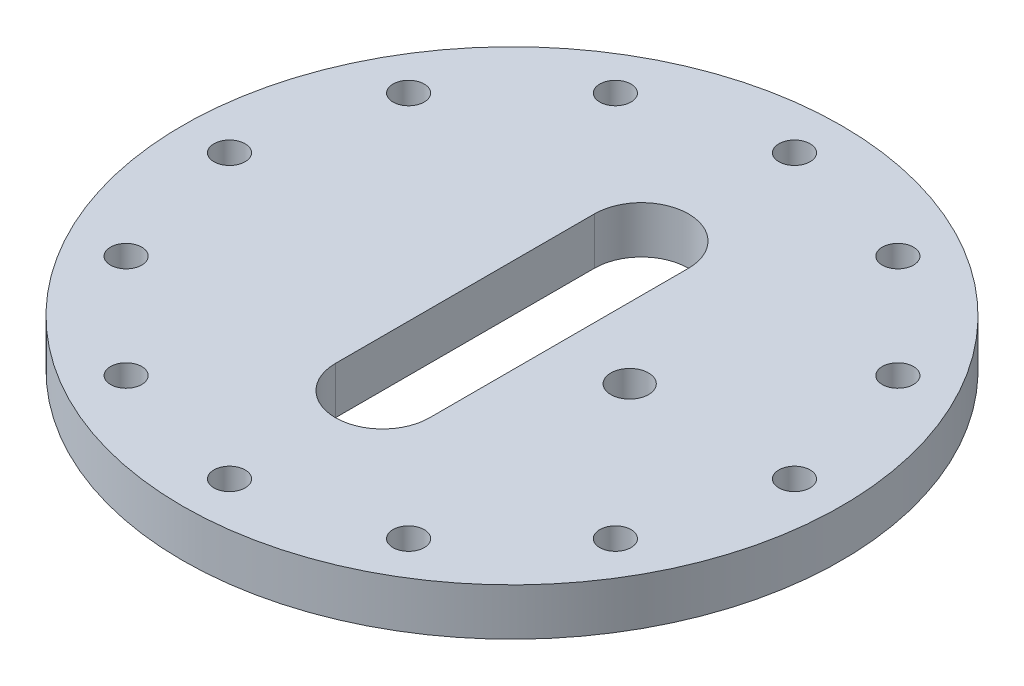
ISO-10303-21;
HEADER;
FILE_DESCRIPTION(('STEP AP214'),'2;1');
FILE_NAME('part.step','',(''),(''),'','','');
FILE_SCHEMA(('AUTOMOTIVE_DESIGN { 1 0 10303 214 1 1 1 1 }'));
ENDSEC;
DATA;
#1=APPLICATION_CONTEXT('core data for automotive mechanical design processes');
#2=APPLICATION_PROTOCOL_DEFINITION('international standard','automotive_design',2000,#1);
#3=PRODUCT_CONTEXT('',#1,'mechanical');
#4=PRODUCT('Part','Part','',(#3));
#5=PRODUCT_RELATED_PRODUCT_CATEGORY('part','',(#4));
#6=PRODUCT_DEFINITION_FORMATION('','',#4);
#7=PRODUCT_DEFINITION_CONTEXT('part definition',#1,'design');
#8=PRODUCT_DEFINITION('design','',#6,#7);
#9=PRODUCT_DEFINITION_SHAPE('','',#8);
#10=(LENGTH_UNIT() NAMED_UNIT(*) SI_UNIT(.MILLI.,.METRE.));
#11=(NAMED_UNIT(*) PLANE_ANGLE_UNIT() SI_UNIT($,.RADIAN.));
#12=(NAMED_UNIT(*) SI_UNIT($,.STERADIAN.) SOLID_ANGLE_UNIT());
#13=UNCERTAINTY_MEASURE_WITH_UNIT(LENGTH_MEASURE(1.E-05),#10,'distance_accuracy_value','');
#14=(GEOMETRIC_REPRESENTATION_CONTEXT(3) GLOBAL_UNCERTAINTY_ASSIGNED_CONTEXT((#13)) GLOBAL_UNIT_ASSIGNED_CONTEXT((#10,
#11,#12)) REPRESENTATION_CONTEXT('',''));
#15=CARTESIAN_POINT('',(0.,0.,0.));
#16=DIRECTION('',(0.,0.,1.));
#17=DIRECTION('',(1.,0.,0.));
#18=AXIS2_PLACEMENT_3D('',#15,#16,#17);
#19=CARTESIAN_POINT('',(0.,0.,0.));
#20=DIRECTION('',(0.,-1.,0.));
#21=DIRECTION('',(0.,0.,-1.));
#22=AXIS2_PLACEMENT_3D('',#19,#20,#21);
#23=PLANE('',#22);
#24=CARTESIAN_POINT('',(31.75,0.,0.));
#25=DIRECTION('',(0.,1.,0.));
#26=DIRECTION('',(0.,0.,1.));
#27=AXIS2_PLACEMENT_3D('',#24,#25,#26);
#28=CIRCLE('',#27,5.07999999999999);
#29=CARTESIAN_POINT('',(31.75,0.,5.07999999999999));
#30=VERTEX_POINT('',#29);
#31=EDGE_CURVE('E213',#30,#30,#28,.T.);
#32=ORIENTED_EDGE('',*,*,#31,.T.);
#33=EDGE_LOOP('',(#32));
#34=FACE_BOUND('',#33,.T.);
#35=CARTESIAN_POINT('',(-38.0999999999992,0.,-65.9911357683747));
#36=DIRECTION('',(0.,1.,0.));
#37=DIRECTION('',(0.,0.,1.));
#38=AXIS2_PLACEMENT_3D('',#35,#36,#37);
#39=CIRCLE('',#38,4.21639999999999);
#40=CARTESIAN_POINT('',(-38.0999999999992,0.,-61.7747357683747));
#41=VERTEX_POINT('',#40);
#42=EDGE_CURVE('E226',#41,#41,#39,.T.);
#43=ORIENTED_EDGE('',*,*,#42,.T.);
#44=EDGE_LOOP('',(#43));
#45=FACE_BOUND('',#44,.T.);
#46=CARTESIAN_POINT('',(-65.9911357683738,0.,-38.1000000000008));
#47=DIRECTION('',(0.,1.,0.));
#48=DIRECTION('',(0.,0.,1.));
#49=AXIS2_PLACEMENT_3D('',#46,#47,#48);
#50=CIRCLE('',#49,4.21639999999999);
#51=CARTESIAN_POINT('',(-65.9911357683738,0.,-33.8836000000008));
#52=VERTEX_POINT('',#51);
#53=EDGE_CURVE('E234',#52,#52,#50,.T.);
#54=ORIENTED_EDGE('',*,*,#53,.T.);
#55=EDGE_LOOP('',(#54));
#56=FACE_BOUND('',#55,.T.);
#57=CARTESIAN_POINT('',(0.,0.,76.2));
#58=DIRECTION('',(0.,1.,0.));
#59=DIRECTION('',(0.,0.,1.));
#60=AXIS2_PLACEMENT_3D('',#57,#58,#59);
#61=CIRCLE('',#60,4.2164);
#62=CARTESIAN_POINT('',(0.,0.,80.4164));
#63=VERTEX_POINT('',#62);
#64=EDGE_CURVE('E266',#63,#63,#61,.T.);
#65=ORIENTED_EDGE('',*,*,#64,.T.);
#66=EDGE_LOOP('',(#65));
#67=FACE_BOUND('',#66,.T.);
#68=CARTESIAN_POINT('',(38.0999999999996,0.,65.9911357683744));
#69=DIRECTION('',(0.,1.,0.));
#70=DIRECTION('',(0.,0.,1.));
#71=AXIS2_PLACEMENT_3D('',#68,#69,#70);
#72=CIRCLE('',#71,4.21639999999999);
#73=CARTESIAN_POINT('',(38.0999999999996,0.,70.2075357683745));
#74=VERTEX_POINT('',#73);
#75=EDGE_CURVE('E274',#74,#74,#72,.T.);
#76=ORIENTED_EDGE('',*,*,#75,.T.);
#77=EDGE_LOOP('',(#76));
#78=FACE_BOUND('',#77,.T.);
#79=CARTESIAN_POINT('',(65.9911357683741,0.,38.1000000000003));
#80=DIRECTION('',(0.,1.,0.));
#81=DIRECTION('',(0.,0.,1.));
#82=AXIS2_PLACEMENT_3D('',#79,#80,#81);
#83=CIRCLE('',#82,4.21639999999999);
#84=CARTESIAN_POINT('',(65.9911357683741,0.,42.3164000000003));
#85=VERTEX_POINT('',#84);
#86=EDGE_CURVE('E282',#85,#85,#83,.T.);
#87=ORIENTED_EDGE('',*,*,#86,.T.);
#88=EDGE_LOOP('',(#87));
#89=FACE_BOUND('',#88,.T.);
#90=CARTESIAN_POINT('',(76.2,0.,2.66050878019847E-13));
#91=DIRECTION('',(0.,1.,0.));
#92=DIRECTION('',(0.,0.,1.));
#93=AXIS2_PLACEMENT_3D('',#90,#91,#92);
#94=CIRCLE('',#93,4.21639999999999);
#95=CARTESIAN_POINT('',(76.2,0.,4.21640000000026));
#96=VERTEX_POINT('',#95);
#97=EDGE_CURVE('E290',#96,#96,#94,.T.);
#98=ORIENTED_EDGE('',*,*,#97,.T.);
#99=EDGE_LOOP('',(#98));
#100=FACE_BOUND('',#99,.T.);
#101=CARTESIAN_POINT('',(65.9911357683743,0.,-38.0999999999999));
#102=DIRECTION('',(0.,1.,0.));
#103=DIRECTION('',(0.,0.,1.));
#104=AXIS2_PLACEMENT_3D('',#101,#102,#103);
#105=CIRCLE('',#104,4.21639999999999);
#106=CARTESIAN_POINT('',(65.9911357683743,0.,-33.8835999999999));
#107=VERTEX_POINT('',#106);
#108=EDGE_CURVE('E298',#107,#107,#105,.T.);
#109=ORIENTED_EDGE('',*,*,#108,.T.);
#110=EDGE_LOOP('',(#109));
#111=FACE_BOUND('',#110,.T.);
#112=CARTESIAN_POINT('',(38.1000000000001,0.,-65.9911357683742));
#113=DIRECTION('',(0.,1.,0.));
#114=DIRECTION('',(0.,0.,1.));
#115=AXIS2_PLACEMENT_3D('',#112,#113,#114);
#116=CIRCLE('',#115,4.21639999999999);
#117=CARTESIAN_POINT('',(38.1000000000001,0.,-61.7747357683742));
#118=VERTEX_POINT('',#117);
#119=EDGE_CURVE('E306',#118,#118,#116,.T.);
#120=ORIENTED_EDGE('',*,*,#119,.T.);
#121=EDGE_LOOP('',(#120));
#122=FACE_BOUND('',#121,.T.);
#123=CARTESIAN_POINT('',(0.,0.,-76.2));
#124=DIRECTION('',(0.,1.,0.));
#125=DIRECTION('',(0.,0.,1.));
#126=AXIS2_PLACEMENT_3D('',#123,#124,#125);
#127=CIRCLE('',#126,4.2164);
#128=CARTESIAN_POINT('',(0.,0.,-71.9836));
#129=VERTEX_POINT('',#128);
#130=EDGE_CURVE('E107',#129,#129,#127,.T.);
#131=ORIENTED_EDGE('',*,*,#130,.T.);
#132=EDGE_LOOP('',(#131));
#133=FACE_BOUND('',#132,.T.);
#134=CARTESIAN_POINT('',(0.,0.,-34.925));
#135=DIRECTION('',(0.,1.,0.));
#136=DIRECTION('',(0.,0.,-1.));
#137=AXIS2_PLACEMENT_3D('',#134,#135,#136);
#138=CIRCLE('',#137,12.7);
#139=CARTESIAN_POINT('',(12.7,0.,-34.925));
#140=VERTEX_POINT('',#139);
#141=CARTESIAN_POINT('',(-12.7,0.,-34.925));
#142=VERTEX_POINT('',#141);
#143=EDGE_CURVE('E82',#140,#142,#138,.T.);
#144=ORIENTED_EDGE('',*,*,#143,.T.);
#145=DIRECTION('',(0.,0.,1.));
#146=VECTOR('',#145,1.);
#147=CARTESIAN_POINT('',(-12.7,0.,-34.925));
#148=LINE('',#147,#146);
#149=CARTESIAN_POINT('',(-12.7,0.,34.925));
#150=VERTEX_POINT('',#149);
#151=EDGE_CURVE('E92',#142,#150,#148,.T.);
#152=ORIENTED_EDGE('',*,*,#151,.T.);
#153=CARTESIAN_POINT('',(0.,0.,34.925));
#154=DIRECTION('',(0.,1.,0.));
#155=DIRECTION('',(0.,0.,1.));
#156=AXIS2_PLACEMENT_3D('',#153,#154,#155);
#157=CIRCLE('',#156,12.7);
#158=CARTESIAN_POINT('',(12.7,0.,34.925));
#159=VERTEX_POINT('',#158);
#160=EDGE_CURVE('E54',#150,#159,#157,.T.);
#161=ORIENTED_EDGE('',*,*,#160,.T.);
#162=DIRECTION('',(0.,0.,-1.));
#163=VECTOR('',#162,1.);
#164=CARTESIAN_POINT('',(12.7,0.,-34.925));
#165=LINE('',#164,#163);
#166=EDGE_CURVE('E89',#159,#140,#165,.T.);
#167=ORIENTED_EDGE('',*,*,#166,.T.);
#168=EDGE_LOOP('',(#144,#152,#161,#167));
#169=FACE_BOUND('',#168,.T.);
#170=CARTESIAN_POINT('',(0.,0.,0.));
#171=DIRECTION('',(0.,1.,0.));
#172=DIRECTION('',(0.,0.,1.));
#173=AXIS2_PLACEMENT_3D('',#170,#171,#172);
#174=CIRCLE('',#173,88.9);
#175=CARTESIAN_POINT('',(0.,0.,88.9));
#176=VERTEX_POINT('',#175);
#177=EDGE_CURVE('E11',#176,#176,#174,.T.);
#178=ORIENTED_EDGE('',*,*,#177,.F.);
#179=EDGE_LOOP('',(#178));
#180=FACE_BOUND('',#179,.T.);
#181=CARTESIAN_POINT('',(-38.1000000000005,0.,65.9911357683739));
#182=DIRECTION('',(0.,1.,0.));
#183=DIRECTION('',(0.,0.,1.));
#184=AXIS2_PLACEMENT_3D('',#181,#182,#183);
#185=CIRCLE('',#184,4.21639999999999);
#186=CARTESIAN_POINT('',(-38.1000000000005,0.,70.2075357683739));
#187=VERTEX_POINT('',#186);
#188=EDGE_CURVE('E258',#187,#187,#185,.T.);
#189=ORIENTED_EDGE('',*,*,#188,.T.);
#190=EDGE_LOOP('',(#189));
#191=FACE_BOUND('',#190,.T.);
#192=CARTESIAN_POINT('',(-65.9911357683746,0.,38.0999999999994));
#193=DIRECTION('',(0.,1.,0.));
#194=DIRECTION('',(0.,0.,1.));
#195=AXIS2_PLACEMENT_3D('',#192,#193,#194);
#196=CIRCLE('',#195,4.21639999999999);
#197=CARTESIAN_POINT('',(-65.9911357683746,0.,42.3163999999994));
#198=VERTEX_POINT('',#197);
#199=EDGE_CURVE('E250',#198,#198,#196,.T.);
#200=ORIENTED_EDGE('',*,*,#199,.T.);
#201=EDGE_LOOP('',(#200));
#202=FACE_BOUND('',#201,.T.);
#203=CARTESIAN_POINT('',(-76.2,0.,-7.9815263405954E-13));
#204=DIRECTION('',(0.,1.,0.));
#205=DIRECTION('',(0.,0.,1.));
#206=AXIS2_PLACEMENT_3D('',#203,#204,#205);
#207=CIRCLE('',#206,4.21639999999999);
#208=CARTESIAN_POINT('',(-76.2,0.,4.2163999999992));
#209=VERTEX_POINT('',#208);
#210=EDGE_CURVE('E242',#209,#209,#207,.T.);
#211=ORIENTED_EDGE('',*,*,#210,.T.);
#212=EDGE_LOOP('',(#211));
#213=FACE_BOUND('',#212,.T.);
#214=ADVANCED_FACE('F39',(#34,#45,#56,#67,#78,#89,#100,#111,#122,#133,#169,#180,#191,#202,#213),
#23,.T.);
#215=CARTESIAN_POINT('',(0.,12.7,0.));
#216=DIRECTION('',(0.,1.,0.));
#217=DIRECTION('',(0.,0.,1.));
#218=AXIS2_PLACEMENT_3D('',#215,#216,#217);
#219=CYLINDRICAL_SURFACE('',#218,88.9);
#220=ORIENTED_EDGE('',*,*,#177,.T.);
#221=EDGE_LOOP('',(#220));
#222=FACE_BOUND('',#221,.T.);
#223=CARTESIAN_POINT('',(0.,12.7,0.));
#224=DIRECTION('',(0.,1.,0.));
#225=DIRECTION('',(0.,0.,1.));
#226=AXIS2_PLACEMENT_3D('',#223,#224,#225);
#227=CIRCLE('',#226,88.9);
#228=CARTESIAN_POINT('',(0.,12.7,88.9));
#229=VERTEX_POINT('',#228);
#230=EDGE_CURVE('E47',#229,#229,#227,.T.);
#231=ORIENTED_EDGE('',*,*,#230,.F.);
#232=EDGE_LOOP('',(#231));
#233=FACE_BOUND('',#232,.T.);
#234=ADVANCED_FACE('F135',(#222,#233),#219,.T.);
#235=CARTESIAN_POINT('',(-88.9,12.7,0.));
#236=DIRECTION('',(0.,1.,0.));
#237=DIRECTION('',(0.,0.,1.));
#238=AXIS2_PLACEMENT_3D('',#235,#236,#237);
#239=PLANE('',#238);
#240=CARTESIAN_POINT('',(31.75,12.7,0.));
#241=DIRECTION('',(0.,1.,0.));
#242=DIRECTION('',(0.,0.,1.));
#243=AXIS2_PLACEMENT_3D('',#240,#241,#242);
#244=CIRCLE('',#243,5.08);
#245=CARTESIAN_POINT('',(31.75,12.7,5.08));
#246=VERTEX_POINT('',#245);
#247=EDGE_CURVE('E216',#246,#246,#244,.T.);
#248=ORIENTED_EDGE('',*,*,#247,.F.);
#249=EDGE_LOOP('',(#248));
#250=FACE_BOUND('',#249,.T.);
#251=CARTESIAN_POINT('',(-38.0999999999992,12.7,-65.9911357683747));
#252=DIRECTION('',(0.,1.,0.));
#253=DIRECTION('',(0.,0.,1.));
#254=AXIS2_PLACEMENT_3D('',#251,#252,#253);
#255=CIRCLE('',#254,4.2164);
#256=CARTESIAN_POINT('',(-38.0999999999992,12.7,-61.7747357683747));
#257=VERTEX_POINT('',#256);
#258=EDGE_CURVE('E220',#257,#257,#255,.T.);
#259=ORIENTED_EDGE('',*,*,#258,.F.);
#260=EDGE_LOOP('',(#259));
#261=FACE_BOUND('',#260,.T.);
#262=CARTESIAN_POINT('',(-65.9911357683738,12.7,-38.1000000000008));
#263=DIRECTION('',(0.,1.,0.));
#264=DIRECTION('',(0.,0.,1.));
#265=AXIS2_PLACEMENT_3D('',#262,#263,#264);
#266=CIRCLE('',#265,4.21639999999999);
#267=CARTESIAN_POINT('',(-65.9911357683738,12.7,-33.8836000000008));
#268=VERTEX_POINT('',#267);
#269=EDGE_CURVE('E230',#268,#268,#266,.T.);
#270=ORIENTED_EDGE('',*,*,#269,.F.);
#271=EDGE_LOOP('',(#270));
#272=FACE_BOUND('',#271,.T.);
#273=CARTESIAN_POINT('',(-76.2,12.7,-7.9815263405954E-13));
#274=DIRECTION('',(0.,1.,0.));
#275=DIRECTION('',(0.,0.,1.));
#276=AXIS2_PLACEMENT_3D('',#273,#274,#275);
#277=CIRCLE('',#276,4.21639999999999);
#278=CARTESIAN_POINT('',(-76.2,12.7,4.2163999999992));
#279=VERTEX_POINT('',#278);
#280=EDGE_CURVE('E238',#279,#279,#277,.T.);
#281=ORIENTED_EDGE('',*,*,#280,.F.);
#282=EDGE_LOOP('',(#281));
#283=FACE_BOUND('',#282,.T.);
#284=CARTESIAN_POINT('',(-65.9911357683746,12.7,38.0999999999994));
#285=DIRECTION('',(0.,1.,0.));
#286=DIRECTION('',(0.,0.,1.));
#287=AXIS2_PLACEMENT_3D('',#284,#285,#286);
#288=CIRCLE('',#287,4.21639999999999);
#289=CARTESIAN_POINT('',(-65.9911357683746,12.7,42.3163999999994));
#290=VERTEX_POINT('',#289);
#291=EDGE_CURVE('E246',#290,#290,#288,.T.);
#292=ORIENTED_EDGE('',*,*,#291,.F.);
#293=EDGE_LOOP('',(#292));
#294=FACE_BOUND('',#293,.T.);
#295=CARTESIAN_POINT('',(-38.1000000000005,12.7,65.9911357683739));
#296=DIRECTION('',(0.,1.,0.));
#297=DIRECTION('',(0.,0.,1.));
#298=AXIS2_PLACEMENT_3D('',#295,#296,#297);
#299=CIRCLE('',#298,4.2164);
#300=CARTESIAN_POINT('',(-38.1000000000005,12.7,70.2075357683739));
#301=VERTEX_POINT('',#300);
#302=EDGE_CURVE('E254',#301,#301,#299,.T.);
#303=ORIENTED_EDGE('',*,*,#302,.F.);
#304=EDGE_LOOP('',(#303));
#305=FACE_BOUND('',#304,.T.);
#306=CARTESIAN_POINT('',(0.,12.7,76.2));
#307=DIRECTION('',(0.,1.,0.));
#308=DIRECTION('',(0.,0.,1.));
#309=AXIS2_PLACEMENT_3D('',#306,#307,#308);
#310=CIRCLE('',#309,4.2164);
#311=CARTESIAN_POINT('',(0.,12.7,80.4164));
#312=VERTEX_POINT('',#311);
#313=EDGE_CURVE('E262',#312,#312,#310,.T.);
#314=ORIENTED_EDGE('',*,*,#313,.F.);
#315=EDGE_LOOP('',(#314));
#316=FACE_BOUND('',#315,.T.);
#317=CARTESIAN_POINT('',(38.0999999999996,12.7,65.9911357683744));
#318=DIRECTION('',(0.,1.,0.));
#319=DIRECTION('',(0.,0.,1.));
#320=AXIS2_PLACEMENT_3D('',#317,#318,#319);
#321=CIRCLE('',#320,4.21639999999999);
#322=CARTESIAN_POINT('',(38.0999999999996,12.7,70.2075357683745));
#323=VERTEX_POINT('',#322);
#324=EDGE_CURVE('E270',#323,#323,#321,.T.);
#325=ORIENTED_EDGE('',*,*,#324,.F.);
#326=EDGE_LOOP('',(#325));
#327=FACE_BOUND('',#326,.T.);
#328=CARTESIAN_POINT('',(65.9911357683741,12.7,38.1000000000003));
#329=DIRECTION('',(0.,1.,0.));
#330=DIRECTION('',(0.,0.,1.));
#331=AXIS2_PLACEMENT_3D('',#328,#329,#330);
#332=CIRCLE('',#331,4.21639999999999);
#333=CARTESIAN_POINT('',(65.9911357683741,12.7,42.3164000000003));
#334=VERTEX_POINT('',#333);
#335=EDGE_CURVE('E278',#334,#334,#332,.T.);
#336=ORIENTED_EDGE('',*,*,#335,.F.);
#337=EDGE_LOOP('',(#336));
#338=FACE_BOUND('',#337,.T.);
#339=CARTESIAN_POINT('',(76.2,12.7,2.66050878019847E-13));
#340=DIRECTION('',(0.,1.,0.));
#341=DIRECTION('',(0.,0.,1.));
#342=AXIS2_PLACEMENT_3D('',#339,#340,#341);
#343=CIRCLE('',#342,4.21639999999999);
#344=CARTESIAN_POINT('',(76.2,12.7,4.21640000000026));
#345=VERTEX_POINT('',#344);
#346=EDGE_CURVE('E286',#345,#345,#343,.T.);
#347=ORIENTED_EDGE('',*,*,#346,.F.);
#348=EDGE_LOOP('',(#347));
#349=FACE_BOUND('',#348,.T.);
#350=CARTESIAN_POINT('',(65.9911357683743,12.7,-38.0999999999999));
#351=DIRECTION('',(0.,1.,0.));
#352=DIRECTION('',(0.,0.,1.));
#353=AXIS2_PLACEMENT_3D('',#350,#351,#352);
#354=CIRCLE('',#353,4.21639999999999);
#355=CARTESIAN_POINT('',(65.9911357683743,12.7,-33.8835999999999));
#356=VERTEX_POINT('',#355);
#357=EDGE_CURVE('E294',#356,#356,#354,.T.);
#358=ORIENTED_EDGE('',*,*,#357,.F.);
#359=EDGE_LOOP('',(#358));
#360=FACE_BOUND('',#359,.T.);
#361=CARTESIAN_POINT('',(38.1000000000001,12.7,-65.9911357683742));
#362=DIRECTION('',(0.,1.,0.));
#363=DIRECTION('',(0.,0.,1.));
#364=AXIS2_PLACEMENT_3D('',#361,#362,#363);
#365=CIRCLE('',#364,4.21639999999999);
#366=CARTESIAN_POINT('',(38.1000000000001,12.7,-61.7747357683742));
#367=VERTEX_POINT('',#366);
#368=EDGE_CURVE('E302',#367,#367,#365,.T.);
#369=ORIENTED_EDGE('',*,*,#368,.F.);
#370=EDGE_LOOP('',(#369));
#371=FACE_BOUND('',#370,.T.);
#372=CARTESIAN_POINT('',(0.,12.7,-76.2));
#373=DIRECTION('',(0.,1.,0.));
#374=DIRECTION('',(0.,0.,1.));
#375=AXIS2_PLACEMENT_3D('',#372,#373,#374);
#376=CIRCLE('',#375,4.2164);
#377=CARTESIAN_POINT('',(0.,12.7,-71.9836));
#378=VERTEX_POINT('',#377);
#379=EDGE_CURVE('E309',#378,#378,#376,.T.);
#380=ORIENTED_EDGE('',*,*,#379,.F.);
#381=EDGE_LOOP('',(#380));
#382=FACE_BOUND('',#381,.T.);
#383=CARTESIAN_POINT('',(0.,12.7,-34.925));
#384=DIRECTION('',(0.,1.,0.));
#385=DIRECTION('',(0.,0.,-1.));
#386=AXIS2_PLACEMENT_3D('',#383,#384,#385);
#387=CIRCLE('',#386,12.7);
#388=CARTESIAN_POINT('',(12.7,12.7,-34.925));
#389=VERTEX_POINT('',#388);
#390=CARTESIAN_POINT('',(-12.7,12.7,-34.925));
#391=VERTEX_POINT('',#390);
#392=EDGE_CURVE('E62',#389,#391,#387,.T.);
#393=ORIENTED_EDGE('',*,*,#392,.F.);
#394=DIRECTION('',(0.,0.,-1.));
#395=VECTOR('',#394,1.);
#396=CARTESIAN_POINT('',(12.7,12.7,-34.925));
#397=LINE('',#396,#395);
#398=CARTESIAN_POINT('',(12.7,12.7,34.925));
#399=VERTEX_POINT('',#398);
#400=EDGE_CURVE('E100',#399,#389,#397,.T.);
#401=ORIENTED_EDGE('',*,*,#400,.F.);
#402=CARTESIAN_POINT('',(0.,12.7,34.925));
#403=DIRECTION('',(0.,1.,0.));
#404=DIRECTION('',(0.,0.,1.));
#405=AXIS2_PLACEMENT_3D('',#402,#403,#404);
#406=CIRCLE('',#405,12.7);
#407=CARTESIAN_POINT('',(-12.7,12.7,34.925));
#408=VERTEX_POINT('',#407);
#409=EDGE_CURVE('E104',#408,#399,#406,.T.);
#410=ORIENTED_EDGE('',*,*,#409,.F.);
#411=DIRECTION('',(0.,0.,1.));
#412=VECTOR('',#411,1.);
#413=CARTESIAN_POINT('',(-12.7,12.7,-34.925));
#414=LINE('',#413,#412);
#415=EDGE_CURVE('E116',#391,#408,#414,.T.);
#416=ORIENTED_EDGE('',*,*,#415,.F.);
#417=EDGE_LOOP('',(#393,#401,#410,#416));
#418=FACE_BOUND('',#417,.T.);
#419=ORIENTED_EDGE('',*,*,#230,.T.);
#420=EDGE_LOOP('',(#419));
#421=FACE_BOUND('',#420,.T.);
#422=ADVANCED_FACE('F133',(#250,#261,#272,#283,#294,#305,#316,#327,#338,#349,#360,#371,#382,
#418,#421),#239,.T.);
#423=CARTESIAN_POINT('',(0.,0.,-34.925));
#424=DIRECTION('',(0.,1.,0.));
#425=DIRECTION('',(0.,0.,1.));
#426=AXIS2_PLACEMENT_3D('',#423,#424,#425);
#427=CYLINDRICAL_SURFACE('',#426,12.7);
#428=ORIENTED_EDGE('',*,*,#392,.T.);
#429=DIRECTION('',(0.,1.,0.));
#430=VECTOR('',#429,1.);
#431=CARTESIAN_POINT('',(-12.7,0.,-34.925));
#432=LINE('',#431,#430);
#433=EDGE_CURVE('E78',#142,#391,#432,.T.);
#434=ORIENTED_EDGE('',*,*,#433,.F.);
#435=ORIENTED_EDGE('',*,*,#143,.F.);
#436=DIRECTION('',(0.,1.,0.));
#437=VECTOR('',#436,1.);
#438=CARTESIAN_POINT('',(12.7,0.,-34.925));
#439=LINE('',#438,#437);
#440=EDGE_CURVE('E122',#140,#389,#439,.T.);
#441=ORIENTED_EDGE('',*,*,#440,.T.);
#442=EDGE_LOOP('',(#428,#434,#435,#441));
#443=FACE_BOUND('',#442,.T.);
#444=ADVANCED_FACE('F80',(#443),#427,.F.);
#445=CARTESIAN_POINT('',(12.7,0.,-34.925));
#446=DIRECTION('',(1.,0.,0.));
#447=DIRECTION('',(0.,0.,-1.));
#448=AXIS2_PLACEMENT_3D('',#445,#446,#447);
#449=PLANE('',#448);
#450=ORIENTED_EDGE('',*,*,#400,.T.);
#451=ORIENTED_EDGE('',*,*,#440,.F.);
#452=ORIENTED_EDGE('',*,*,#166,.F.);
#453=DIRECTION('',(0.,1.,0.));
#454=VECTOR('',#453,1.);
#455=CARTESIAN_POINT('',(12.7,0.,34.925));
#456=LINE('',#455,#454);
#457=EDGE_CURVE('E125',#159,#399,#456,.T.);
#458=ORIENTED_EDGE('',*,*,#457,.T.);
#459=EDGE_LOOP('',(#450,#451,#452,#458));
#460=FACE_BOUND('',#459,.T.);
#461=ADVANCED_FACE('F148',(#460),#449,.F.);
#462=CARTESIAN_POINT('',(0.,0.,34.925));
#463=DIRECTION('',(0.,1.,0.));
#464=DIRECTION('',(0.,0.,1.));
#465=AXIS2_PLACEMENT_3D('',#462,#463,#464);
#466=CYLINDRICAL_SURFACE('',#465,12.7);
#467=ORIENTED_EDGE('',*,*,#409,.T.);
#468=ORIENTED_EDGE('',*,*,#457,.F.);
#469=ORIENTED_EDGE('',*,*,#160,.F.);
#470=DIRECTION('',(0.,1.,0.));
#471=VECTOR('',#470,1.);
#472=CARTESIAN_POINT('',(-12.7,0.,34.925));
#473=LINE('',#472,#471);
#474=EDGE_CURVE('E88',#150,#408,#473,.T.);
#475=ORIENTED_EDGE('',*,*,#474,.T.);
#476=EDGE_LOOP('',(#467,#468,#469,#475));
#477=FACE_BOUND('',#476,.T.);
#478=ADVANCED_FACE('F152',(#477),#466,.F.);
#479=CARTESIAN_POINT('',(-12.7,0.,-34.925));
#480=DIRECTION('',(-1.,0.,0.));
#481=DIRECTION('',(0.,0.,1.));
#482=AXIS2_PLACEMENT_3D('',#479,#480,#481);
#483=PLANE('',#482);
#484=ORIENTED_EDGE('',*,*,#415,.T.);
#485=ORIENTED_EDGE('',*,*,#474,.F.);
#486=ORIENTED_EDGE('',*,*,#151,.F.);
#487=ORIENTED_EDGE('',*,*,#433,.T.);
#488=EDGE_LOOP('',(#484,#485,#486,#487));
#489=FACE_BOUND('',#488,.T.);
#490=ADVANCED_FACE('F93',(#489),#483,.F.);
#491=CARTESIAN_POINT('',(0.,12.7,-76.2));
#492=DIRECTION('',(0.,1.,0.));
#493=DIRECTION('',(0.,0.,1.));
#494=AXIS2_PLACEMENT_3D('',#491,#492,#493);
#495=CYLINDRICAL_SURFACE('',#494,4.2164);
#496=ORIENTED_EDGE('',*,*,#130,.F.);
#497=EDGE_LOOP('',(#496));
#498=FACE_BOUND('',#497,.T.);
#499=ORIENTED_EDGE('',*,*,#379,.T.);
#500=EDGE_LOOP('',(#499));
#501=FACE_BOUND('',#500,.T.);
#502=ADVANCED_FACE('F151',(#498,#501),#495,.F.);
#503=CARTESIAN_POINT('',(38.1000000000001,12.7,-65.9911357683742));
#504=DIRECTION('',(0.,1.,0.));
#505=DIRECTION('',(0.,0.,1.));
#506=AXIS2_PLACEMENT_3D('',#503,#504,#505);
#507=CYLINDRICAL_SURFACE('',#506,4.21639999999999);
#508=ORIENTED_EDGE('',*,*,#119,.F.);
#509=EDGE_LOOP('',(#508));
#510=FACE_BOUND('',#509,.T.);
#511=ORIENTED_EDGE('',*,*,#368,.T.);
#512=EDGE_LOOP('',(#511));
#513=FACE_BOUND('',#512,.T.);
#514=ADVANCED_FACE('F160',(#510,#513),#507,.F.);
#515=CARTESIAN_POINT('',(65.9911357683743,12.7,-38.0999999999999));
#516=DIRECTION('',(0.,1.,0.));
#517=DIRECTION('',(0.,0.,1.));
#518=AXIS2_PLACEMENT_3D('',#515,#516,#517);
#519=CYLINDRICAL_SURFACE('',#518,4.21639999999999);
#520=ORIENTED_EDGE('',*,*,#108,.F.);
#521=EDGE_LOOP('',(#520));
#522=FACE_BOUND('',#521,.T.);
#523=ORIENTED_EDGE('',*,*,#357,.T.);
#524=EDGE_LOOP('',(#523));
#525=FACE_BOUND('',#524,.T.);
#526=ADVANCED_FACE('F164',(#522,#525),#519,.F.);
#527=CARTESIAN_POINT('',(76.2,12.7,2.66050878019847E-13));
#528=DIRECTION('',(0.,1.,0.));
#529=DIRECTION('',(0.,0.,1.));
#530=AXIS2_PLACEMENT_3D('',#527,#528,#529);
#531=CYLINDRICAL_SURFACE('',#530,4.21639999999999);
#532=ORIENTED_EDGE('',*,*,#97,.F.);
#533=EDGE_LOOP('',(#532));
#534=FACE_BOUND('',#533,.T.);
#535=ORIENTED_EDGE('',*,*,#346,.T.);
#536=EDGE_LOOP('',(#535));
#537=FACE_BOUND('',#536,.T.);
#538=ADVANCED_FACE('F168',(#534,#537),#531,.F.);
#539=CARTESIAN_POINT('',(65.9911357683741,12.7,38.1000000000003));
#540=DIRECTION('',(0.,1.,0.));
#541=DIRECTION('',(0.,0.,1.));
#542=AXIS2_PLACEMENT_3D('',#539,#540,#541);
#543=CYLINDRICAL_SURFACE('',#542,4.21639999999999);
#544=ORIENTED_EDGE('',*,*,#86,.F.);
#545=EDGE_LOOP('',(#544));
#546=FACE_BOUND('',#545,.T.);
#547=ORIENTED_EDGE('',*,*,#335,.T.);
#548=EDGE_LOOP('',(#547));
#549=FACE_BOUND('',#548,.T.);
#550=ADVANCED_FACE('F172',(#546,#549),#543,.F.);
#551=CARTESIAN_POINT('',(38.0999999999996,12.7,65.9911357683744));
#552=DIRECTION('',(0.,1.,0.));
#553=DIRECTION('',(0.,0.,1.));
#554=AXIS2_PLACEMENT_3D('',#551,#552,#553);
#555=CYLINDRICAL_SURFACE('',#554,4.21639999999999);
#556=ORIENTED_EDGE('',*,*,#75,.F.);
#557=EDGE_LOOP('',(#556));
#558=FACE_BOUND('',#557,.T.);
#559=ORIENTED_EDGE('',*,*,#324,.T.);
#560=EDGE_LOOP('',(#559));
#561=FACE_BOUND('',#560,.T.);
#562=ADVANCED_FACE('F176',(#558,#561),#555,.F.);
#563=CARTESIAN_POINT('',(0.,12.7,76.2));
#564=DIRECTION('',(0.,1.,0.));
#565=DIRECTION('',(0.,0.,1.));
#566=AXIS2_PLACEMENT_3D('',#563,#564,#565);
#567=CYLINDRICAL_SURFACE('',#566,4.2164);
#568=ORIENTED_EDGE('',*,*,#64,.F.);
#569=EDGE_LOOP('',(#568));
#570=FACE_BOUND('',#569,.T.);
#571=ORIENTED_EDGE('',*,*,#313,.T.);
#572=EDGE_LOOP('',(#571));
#573=FACE_BOUND('',#572,.T.);
#574=ADVANCED_FACE('F180',(#570,#573),#567,.F.);
#575=CARTESIAN_POINT('',(-38.1000000000005,12.7,65.9911357683739));
#576=DIRECTION('',(0.,1.,0.));
#577=DIRECTION('',(0.,0.,1.));
#578=AXIS2_PLACEMENT_3D('',#575,#576,#577);
#579=CYLINDRICAL_SURFACE('',#578,4.2164);
#580=ORIENTED_EDGE('',*,*,#188,.F.);
#581=EDGE_LOOP('',(#580));
#582=FACE_BOUND('',#581,.T.);
#583=ORIENTED_EDGE('',*,*,#302,.T.);
#584=EDGE_LOOP('',(#583));
#585=FACE_BOUND('',#584,.T.);
#586=ADVANCED_FACE('F184',(#582,#585),#579,.F.);
#587=CARTESIAN_POINT('',(-65.9911357683746,12.7,38.0999999999994));
#588=DIRECTION('',(0.,1.,0.));
#589=DIRECTION('',(0.,0.,1.));
#590=AXIS2_PLACEMENT_3D('',#587,#588,#589);
#591=CYLINDRICAL_SURFACE('',#590,4.21639999999999);
#592=ORIENTED_EDGE('',*,*,#199,.F.);
#593=EDGE_LOOP('',(#592));
#594=FACE_BOUND('',#593,.T.);
#595=ORIENTED_EDGE('',*,*,#291,.T.);
#596=EDGE_LOOP('',(#595));
#597=FACE_BOUND('',#596,.T.);
#598=ADVANCED_FACE('F188',(#594,#597),#591,.F.);
#599=CARTESIAN_POINT('',(-76.2,12.7,-7.9815263405954E-13));
#600=DIRECTION('',(0.,1.,0.));
#601=DIRECTION('',(0.,0.,1.));
#602=AXIS2_PLACEMENT_3D('',#599,#600,#601);
#603=CYLINDRICAL_SURFACE('',#602,4.21639999999999);
#604=ORIENTED_EDGE('',*,*,#210,.F.);
#605=EDGE_LOOP('',(#604));
#606=FACE_BOUND('',#605,.T.);
#607=ORIENTED_EDGE('',*,*,#280,.T.);
#608=EDGE_LOOP('',(#607));
#609=FACE_BOUND('',#608,.T.);
#610=ADVANCED_FACE('F192',(#606,#609),#603,.F.);
#611=CARTESIAN_POINT('',(-65.9911357683738,12.7,-38.1000000000008));
#612=DIRECTION('',(0.,1.,0.));
#613=DIRECTION('',(0.,0.,1.));
#614=AXIS2_PLACEMENT_3D('',#611,#612,#613);
#615=CYLINDRICAL_SURFACE('',#614,4.21639999999999);
#616=ORIENTED_EDGE('',*,*,#53,.F.);
#617=EDGE_LOOP('',(#616));
#618=FACE_BOUND('',#617,.T.);
#619=ORIENTED_EDGE('',*,*,#269,.T.);
#620=EDGE_LOOP('',(#619));
#621=FACE_BOUND('',#620,.T.);
#622=ADVANCED_FACE('F196',(#618,#621),#615,.F.);
#623=CARTESIAN_POINT('',(-38.0999999999992,12.7,-65.9911357683747));
#624=DIRECTION('',(0.,1.,0.));
#625=DIRECTION('',(0.,0.,1.));
#626=AXIS2_PLACEMENT_3D('',#623,#624,#625);
#627=CYLINDRICAL_SURFACE('',#626,4.2164);
#628=ORIENTED_EDGE('',*,*,#42,.F.);
#629=EDGE_LOOP('',(#628));
#630=FACE_BOUND('',#629,.T.);
#631=ORIENTED_EDGE('',*,*,#258,.T.);
#632=EDGE_LOOP('',(#631));
#633=FACE_BOUND('',#632,.T.);
#634=ADVANCED_FACE('F200',(#630,#633),#627,.F.);
#635=CARTESIAN_POINT('',(31.75,12.7,0.));
#636=DIRECTION('',(0.,1.,0.));
#637=DIRECTION('',(0.,0.,1.));
#638=AXIS2_PLACEMENT_3D('',#635,#636,#637);
#639=CYLINDRICAL_SURFACE('',#638,5.08);
#640=ORIENTED_EDGE('',*,*,#31,.F.);
#641=EDGE_LOOP('',(#640));
#642=FACE_BOUND('',#641,.T.);
#643=ORIENTED_EDGE('',*,*,#247,.T.);
#644=EDGE_LOOP('',(#643));
#645=FACE_BOUND('',#644,.T.);
#646=ADVANCED_FACE('F204',(#642,#645),#639,.F.);
#647=CLOSED_SHELL('',(#214,#234,#422,#444,#461,#478,#490,#502,#514,#526,#538,#550,#562,#574,
#586,#598,#610,#622,#634,#646));
#648=MANIFOLD_SOLID_BREP('B2',#647);
#649=ADVANCED_BREP_SHAPE_REPRESENTATION('',(#18,#648),#14);
#650=SHAPE_DEFINITION_REPRESENTATION(#9,#649);
ENDSEC;
END-ISO-10303-21;
